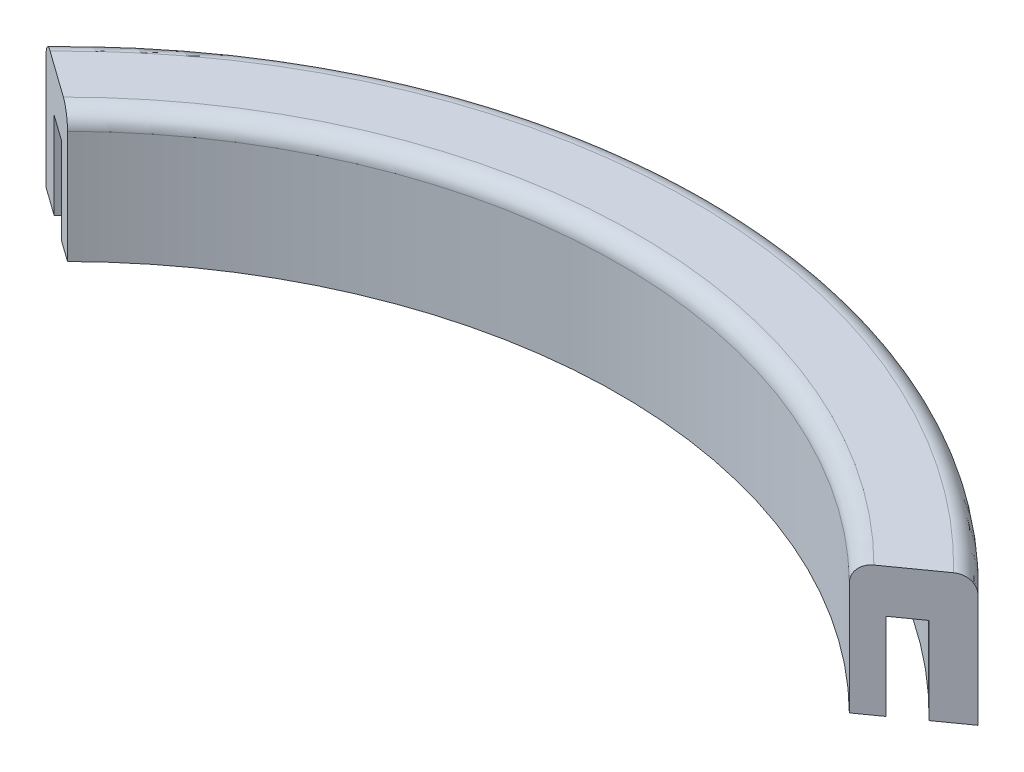
ISO-10303-21;
HEADER;
FILE_DESCRIPTION(('STEP AP214'),'2;1');
FILE_NAME('part.step','',(''),(''),'','','');
FILE_SCHEMA(('AUTOMOTIVE_DESIGN { 1 0 10303 214 1 1 1 1 }'));
ENDSEC;
DATA;
#1=APPLICATION_CONTEXT('core data for automotive mechanical design processes');
#2=APPLICATION_PROTOCOL_DEFINITION('international standard','automotive_design',2000,#1);
#3=PRODUCT_CONTEXT('',#1,'mechanical');
#4=PRODUCT('Part','Part','',(#3));
#5=PRODUCT_RELATED_PRODUCT_CATEGORY('part','',(#4));
#6=PRODUCT_DEFINITION_FORMATION('','',#4);
#7=PRODUCT_DEFINITION_CONTEXT('part definition',#1,'design');
#8=PRODUCT_DEFINITION('design','',#6,#7);
#9=PRODUCT_DEFINITION_SHAPE('','',#8);
#10=(LENGTH_UNIT() NAMED_UNIT(*) SI_UNIT(.MILLI.,.METRE.));
#11=(NAMED_UNIT(*) PLANE_ANGLE_UNIT() SI_UNIT($,.RADIAN.));
#12=(NAMED_UNIT(*) SI_UNIT($,.STERADIAN.) SOLID_ANGLE_UNIT());
#13=UNCERTAINTY_MEASURE_WITH_UNIT(LENGTH_MEASURE(1.E-05),#10,'distance_accuracy_value','');
#14=(GEOMETRIC_REPRESENTATION_CONTEXT(3) GLOBAL_UNCERTAINTY_ASSIGNED_CONTEXT((#13)) GLOBAL_UNIT_ASSIGNED_CONTEXT((#10,
#11,#12)) REPRESENTATION_CONTEXT('',''));
#15=CARTESIAN_POINT('',(0.,0.,0.));
#16=DIRECTION('',(0.,0.,1.));
#17=DIRECTION('',(1.,0.,0.));
#18=AXIS2_PLACEMENT_3D('',#15,#16,#17);
#19=CARTESIAN_POINT('',(0.,0.,0.));
#20=DIRECTION('',(0.,-1.,0.));
#21=DIRECTION('',(0.,0.,-1.));
#22=AXIS2_PLACEMENT_3D('',#19,#20,#21);
#23=PLANE('',#22);
#24=CARTESIAN_POINT('',(0.,0.,0.));
#25=DIRECTION('',(0.,-1.,0.));
#26=DIRECTION('',(0.,0.,-1.));
#27=AXIS2_PLACEMENT_3D('',#24,#25,#26);
#28=CIRCLE('',#27,89.535);
#29=CARTESIAN_POINT('',(-64.0434533645431,0.,-62.569579718451));
#30=VERTEX_POINT('',#29);
#31=CARTESIAN_POINT('',(64.0434533645431,0.,-62.569579718451));
#32=VERTEX_POINT('',#31);
#33=EDGE_CURVE('E122',#30,#32,#28,.T.);
#34=ORIENTED_EDGE('',*,*,#33,.F.);
#35=DIRECTION('',(0.814035572170162,0.,0.580815019814052));
#36=VECTOR('',#35,1.);
#37=CARTESIAN_POINT('',(-57.2347353310245,0.,-57.7115540562509));
#38=LINE('',#37,#36);
#39=CARTESIAN_POINT('',(-68.2255935502987,0.,-65.5535400242385));
#40=VERTEX_POINT('',#39);
#41=EDGE_CURVE('E181',#40,#30,#38,.T.);
#42=ORIENTED_EDGE('',*,*,#41,.F.);
#43=CARTESIAN_POINT('',(0.,0.,0.));
#44=DIRECTION('',(0.,1.,0.));
#45=DIRECTION('',(0.,0.,-1.));
#46=AXIS2_PLACEMENT_3D('',#43,#44,#45);
#47=CIRCLE('',#46,94.615);
#48=CARTESIAN_POINT('',(68.2255935502987,0.,-65.5535400242385));
#49=VERTEX_POINT('',#48);
#50=EDGE_CURVE('E160',#49,#40,#47,.T.);
#51=ORIENTED_EDGE('',*,*,#50,.F.);
#52=DIRECTION('',(0.814035572170162,0.,-0.580815019814052));
#53=VECTOR('',#52,1.);
#54=CARTESIAN_POINT('',(57.2347353310245,0.,-57.7115540562509));
#55=LINE('',#54,#53);
#56=EDGE_CURVE('E189',#32,#49,#55,.T.);
#57=ORIENTED_EDGE('',*,*,#56,.F.);
#58=EDGE_LOOP('',(#34,#42,#51,#57));
#59=FACE_BOUND('',#58,.T.);
#60=ADVANCED_FACE('F38',(#59),#23,.T.);
#61=CARTESIAN_POINT('',(0.,19.05,0.));
#62=DIRECTION('',(0.,-1.,0.));
#63=DIRECTION('',(0.,0.,-1.));
#64=AXIS2_PLACEMENT_3D('',#61,#62,#63);
#65=CYLINDRICAL_SURFACE('',#64,94.615);
#66=DIRECTION('',(0.,-1.,0.));
#67=VECTOR('',#66,1.);
#68=CARTESIAN_POINT('',(-68.2255935502987,19.05,-65.5535400242385));
#69=LINE('',#68,#67);
#70=CARTESIAN_POINT('',(-68.2255935502987,16.51,-65.5535400242385));
#71=VERTEX_POINT('',#70);
#72=EDGE_CURVE('E200',#71,#40,#69,.T.);
#73=ORIENTED_EDGE('',*,*,#72,.F.);
#74=CARTESIAN_POINT('',(0.,16.51,0.));
#75=DIRECTION('',(0.,-1.,0.));
#76=DIRECTION('',(0.,0.,-1.));
#77=AXIS2_PLACEMENT_3D('',#74,#75,#76);
#78=CIRCLE('',#77,94.615);
#79=CARTESIAN_POINT('',(68.2255935502987,16.51,-65.5535400242385));
#80=VERTEX_POINT('',#79);
#81=EDGE_CURVE('E11',#71,#80,#78,.T.);
#82=ORIENTED_EDGE('',*,*,#81,.T.);
#83=DIRECTION('',(0.,-1.,0.));
#84=VECTOR('',#83,1.);
#85=CARTESIAN_POINT('',(68.2255935502987,19.05,-65.5535400242385));
#86=LINE('',#85,#84);
#87=EDGE_CURVE('E176',#80,#49,#86,.T.);
#88=ORIENTED_EDGE('',*,*,#87,.T.);
#89=ORIENTED_EDGE('',*,*,#50,.T.);
#90=EDGE_LOOP('',(#73,#82,#88,#89));
#91=FACE_BOUND('',#90,.T.);
#92=ADVANCED_FACE('F240',(#91),#65,.T.);
#93=CARTESIAN_POINT('',(-57.2347353310245,19.05,-57.7115540562509));
#94=DIRECTION('',(0.580815019814052,0.,-0.814035572170162));
#95=DIRECTION('',(-0.814035572170162,0.,-0.580815019814052));
#96=AXIS2_PLACEMENT_3D('',#93,#94,#95);
#97=PLANE('',#96);
#98=DIRECTION('',(0.,-1.,0.));
#99=VECTOR('',#98,1.);
#100=CARTESIAN_POINT('',(-57.2347353310245,19.05,-57.7115540562509));
#101=LINE('',#100,#99);
#102=CARTESIAN_POINT('',(-57.2347353310245,16.51,-57.7115540562509));
#103=VERTEX_POINT('',#102);
#104=CARTESIAN_POINT('',(-57.2347353310245,0.,-57.7115540562509));
#105=VERTEX_POINT('',#104);
#106=EDGE_CURVE('E197',#103,#105,#101,.T.);
#107=ORIENTED_EDGE('',*,*,#106,.F.);
#108=CARTESIAN_POINT('',(-57.2347353310245,16.51,-57.7115540562509));
#109=CARTESIAN_POINT('',(-57.2347292125334,16.5807027289296,-57.7115496907027));
#110=CARTESIAN_POINT('',(-57.237173461785,16.6514018811038,-57.7132936644626));
#111=CARTESIAN_POINT('',(-57.2469154589435,16.7922884303876,-57.7202445870833));
#112=CARTESIAN_POINT('',(-57.2542128303198,16.8624758667718,-57.7254512672892));
#113=CARTESIAN_POINT('',(-57.2736025490014,17.0017643360062,-57.7392858467908));
#114=CARTESIAN_POINT('',(-57.2856893010382,17.0708665391062,-57.7479097538579));
#115=CARTESIAN_POINT('',(-57.3145521117735,17.2075564949376,-57.7685033919767));
#116=CARTESIAN_POINT('',(-57.331328139965,17.2751442575184,-57.7804731012616));
#117=CARTESIAN_POINT('',(-57.3885344369747,17.4749666658083,-57.8212898390886));
#118=CARTESIAN_POINT('',(-57.4358538106855,17.6043381113576,-57.8550522493801));
#119=CARTESIAN_POINT('',(-57.5473638490288,17.8514867100328,-57.9346147492806));
#120=CARTESIAN_POINT('',(-57.6115535330716,17.969264536493,-57.9804141392382));
#121=CARTESIAN_POINT('',(-57.7553907269823,18.1908514799067,-58.0830420900151));
#122=CARTESIAN_POINT('',(-57.8351345444467,18.2945663658334,-58.1399393663799));
#123=CARTESIAN_POINT('',(-58.0075094791364,18.4843585711963,-58.2629290176065));
#124=CARTESIAN_POINT('',(-58.1001434481603,18.5704319772076,-58.3290234272288));
#125=CARTESIAN_POINT('',(-58.297004126405,18.7237328887879,-58.4694836757047));
#126=CARTESIAN_POINT('',(-58.4013722475935,18.7906861021638,-58.5439504121084));
#127=CARTESIAN_POINT('',(-58.6176848437346,18.9023906695845,-58.6982896192745));
#128=CARTESIAN_POINT('',(-58.7296262860345,18.9471508514795,-58.7781599262368));
#129=CARTESIAN_POINT('',(-58.9236696217515,19.0034225981474,-58.9166099986074));
#130=CARTESIAN_POINT('',(-59.0046645237337,19.0208776014887,-58.974399924758));
#131=CARTESIAN_POINT('',(-59.1676387969249,19.0441658601325,-59.0906821966253));
#132=CARTESIAN_POINT('',(-59.2496166306025,19.0500153566809,-59.1491734453122));
#133=CARTESIAN_POINT('',(-59.33162764036,19.05,-59.2076883651581));
#134=B_SPLINE_CURVE_WITH_KNOTS('',3,(#108,#109,#110,#111,#112,#113,#114,#115,#116,#117,#118,
#119,#120,#121,#122,#123,#124,#125,#126,#127,#128,#129,#130,#131,#132,#133),.UNSPECIFIED.,.F.,
.F.,(4,2,2,2,2,2,2,2,2,2,2,2,4),(0.,0.212038091459266,0.424059733814965,0.635834405439172,
0.84760769935326,1.27092079623805,1.69420929341764,2.12020703134357,2.54629916668803,
2.97822772417059,3.40998433282428,3.71239781108664,4.01438777954809),.UNSPECIFIED.);
#135=CARTESIAN_POINT('',(-59.33162764036,19.05,-59.2076883651581));
#136=VERTEX_POINT('',#135);
#137=EDGE_CURVE('E48',#103,#136,#134,.T.);
#138=ORIENTED_EDGE('',*,*,#137,.T.);
#139=DIRECTION('',(0.814035572170162,0.,0.580815019814052));
#140=VECTOR('',#139,1.);
#141=CARTESIAN_POINT('',(-57.2347353310245,19.05,-57.7115540562509));
#142=LINE('',#141,#140);
#143=CARTESIAN_POINT('',(-66.135180534394,19.05,-64.0620286962809));
#144=VERTEX_POINT('',#143);
#145=EDGE_CURVE('E167',#144,#136,#142,.T.);
#146=ORIENTED_EDGE('',*,*,#145,.F.);
#147=CARTESIAN_POINT('',(-66.135180534394,19.05,-64.0620286962809));
#148=CARTESIAN_POINT('',(-66.1944766345441,19.0499990825189,-64.1043365102894));
#149=CARTESIAN_POINT('',(-66.2537445496103,19.0469343988423,-64.1466242142182));
#150=CARTESIAN_POINT('',(-66.3718602879345,19.0347041977518,-64.230899886241));
#151=CARTESIAN_POINT('',(-66.4307081207936,19.0255388202253,-64.2728878611854));
#152=CARTESIAN_POINT('',(-66.60592574606,18.9889636862598,-64.3979057743701));
#153=CARTESIAN_POINT('',(-66.7211280670028,18.9524747643107,-64.4801027208041));
#154=CARTESIAN_POINT('',(-66.944916393503,18.8562241883581,-64.6397758674503));
#155=CARTESIAN_POINT('',(-67.0534983635128,18.796448500339,-64.7172491882962));
#156=CARTESIAN_POINT('',(-67.2608804153753,18.6552441228344,-64.8652164451084));
#157=CARTESIAN_POINT('',(-67.3596831639858,18.5738213588759,-64.9357122838086));
#158=CARTESIAN_POINT('',(-67.5441121893266,18.3920493313781,-65.0673025381779));
#159=CARTESIAN_POINT('',(-67.6298062095813,18.2918037815529,-65.128445288905));
#160=CARTESIAN_POINT('',(-67.7861215462134,18.074869035856,-65.2399764043097));
#161=CARTESIAN_POINT('',(-67.8567402340852,17.9581769782823,-65.2903628935465));
#162=CARTESIAN_POINT('',(-67.9800986166503,17.712978258467,-65.378379196351));
#163=CARTESIAN_POINT('',(-68.0330138578835,17.5846047019455,-65.4161342625127));
#164=CARTESIAN_POINT('',(-68.1203252283969,17.3187268271553,-65.4784309939192));
#165=CARTESIAN_POINT('',(-68.1547350577661,17.1812293485447,-65.502982434188));
#166=CARTESIAN_POINT('',(-68.1947373250157,16.9539576725633,-65.531524083275));
#167=CARTESIAN_POINT('',(-68.2063016752937,16.8657030757747,-65.5397752562771));
#168=CARTESIAN_POINT('',(-68.2217280877653,16.6883122843,-65.5507820136863));
#169=CARTESIAN_POINT('',(-68.2256011816788,16.59917753685,-65.5535454692343));
#170=CARTESIAN_POINT('',(-68.2255935502987,16.51,-65.5535400242385));
#171=B_SPLINE_CURVE_WITH_KNOTS('',3,(#147,#148,#149,#150,#151,#152,#153,#154,#155,#156,#157,
#158,#159,#160,#161,#162,#163,#164,#165,#166,#167,#168,#169,#170),.UNSPECIFIED.,.F.,.F.,(4,2,2,
2,2,2,2,2,2,2,2,4),(0.,0.218393054742541,0.436781101963117,0.872980821932522,1.3094438299623,
1.74578748629325,2.17979391786544,2.61387596025898,3.04351642178407,3.47283836871294,
3.74054492114632,4.00786721867657),.UNSPECIFIED.);
#172=EDGE_CURVE('E55',#144,#71,#171,.T.);
#173=ORIENTED_EDGE('',*,*,#172,.T.);
#174=ORIENTED_EDGE('',*,*,#72,.T.);
#175=ORIENTED_EDGE('',*,*,#41,.T.);
#176=DIRECTION('',(0.,-1.,0.));
#177=VECTOR('',#176,1.);
#178=CARTESIAN_POINT('',(-64.0434533645431,12.7,-62.569579718451));
#179=LINE('',#178,#177);
#180=CARTESIAN_POINT('',(-64.0434533645431,12.7,-62.569579718451));
#181=VERTEX_POINT('',#180);
#182=EDGE_CURVE('E157',#181,#30,#179,.T.);
#183=ORIENTED_EDGE('',*,*,#182,.F.);
#184=DIRECTION('',(-0.814035572170162,0.,-0.580815019814051));
#185=VECTOR('',#184,1.);
#186=CARTESIAN_POINT('',(-60.3794057355663,12.7,-59.9552788586615));
#187=LINE('',#186,#185);
#188=CARTESIAN_POINT('',(-60.3794057355663,12.7,-59.9552788586615));
#189=VERTEX_POINT('',#188);
#190=EDGE_CURVE('E129',#189,#181,#187,.T.);
#191=ORIENTED_EDGE('',*,*,#190,.F.);
#192=DIRECTION('',(0.,-1.,0.));
#193=VECTOR('',#192,1.);
#194=CARTESIAN_POINT('',(-60.3794057355663,12.7,-59.9552788586615));
#195=LINE('',#194,#193);
#196=CARTESIAN_POINT('',(-60.3794057355663,0.,-59.9552788586615));
#197=VERTEX_POINT('',#196);
#198=EDGE_CURVE('E161',#189,#197,#195,.T.);
#199=ORIENTED_EDGE('',*,*,#198,.T.);
#200=EDGE_CURVE('E180',#197,#105,#38,.T.);
#201=ORIENTED_EDGE('',*,*,#200,.T.);
#202=EDGE_LOOP('',(#107,#138,#146,#173,#174,#175,#183,#191,#199,#201));
#203=FACE_BOUND('',#202,.T.);
#204=ADVANCED_FACE('F236',(#203),#97,.F.);
#205=CARTESIAN_POINT('',(0.,19.05,0.));
#206=DIRECTION('',(0.,-1.,0.));
#207=DIRECTION('',(0.,0.,-1.));
#208=AXIS2_PLACEMENT_3D('',#205,#206,#207);
#209=CYLINDRICAL_SURFACE('',#208,81.28);
#210=DIRECTION('',(0.,-1.,0.));
#211=VECTOR('',#210,1.);
#212=CARTESIAN_POINT('',(57.2347353310245,19.05,-57.711554056251));
#213=LINE('',#212,#211);
#214=CARTESIAN_POINT('',(57.2347353310245,16.51,-57.711554056251));
#215=VERTEX_POINT('',#214);
#216=CARTESIAN_POINT('',(57.2347353310245,0.,-57.711554056251));
#217=VERTEX_POINT('',#216);
#218=EDGE_CURVE('E194',#215,#217,#213,.T.);
#219=ORIENTED_EDGE('',*,*,#218,.F.);
#220=CARTESIAN_POINT('',(0.,16.51,0.));
#221=DIRECTION('',(0.,-1.,0.));
#222=DIRECTION('',(0.,0.,-1.));
#223=AXIS2_PLACEMENT_3D('',#220,#221,#222);
#224=CIRCLE('',#223,81.28);
#225=EDGE_CURVE('E63',#215,#103,#224,.F.);
#226=ORIENTED_EDGE('',*,*,#225,.T.);
#227=ORIENTED_EDGE('',*,*,#106,.T.);
#228=CARTESIAN_POINT('',(0.,0.,0.));
#229=DIRECTION('',(0.,-1.,0.));
#230=DIRECTION('',(0.,0.,-1.));
#231=AXIS2_PLACEMENT_3D('',#228,#229,#230);
#232=CIRCLE('',#231,81.28);
#233=EDGE_CURVE('E185',#105,#217,#232,.T.);
#234=ORIENTED_EDGE('',*,*,#233,.T.);
#235=EDGE_LOOP('',(#219,#226,#227,#234));
#236=FACE_BOUND('',#235,.T.);
#237=ADVANCED_FACE('F230',(#236),#209,.F.);
#238=CARTESIAN_POINT('',(57.2347353310245,19.05,-57.7115540562509));
#239=DIRECTION('',(-0.580815019814052,0.,-0.814035572170162));
#240=DIRECTION('',(-0.814035572170162,0.,0.580815019814052));
#241=AXIS2_PLACEMENT_3D('',#238,#239,#240);
#242=PLANE('',#241);
#243=DIRECTION('',(0.814035572170162,0.,-0.580815019814052));
#244=VECTOR('',#243,1.);
#245=CARTESIAN_POINT('',(57.2347353310245,19.05,-57.7115540562509));
#246=LINE('',#245,#244);
#247=CARTESIAN_POINT('',(59.33162764036,19.05,-59.2076883651581));
#248=VERTEX_POINT('',#247);
#249=CARTESIAN_POINT('',(66.135180534394,19.05,-64.0620286962809));
#250=VERTEX_POINT('',#249);
#251=EDGE_CURVE('E171',#248,#250,#246,.T.);
#252=ORIENTED_EDGE('',*,*,#251,.F.);
#253=CARTESIAN_POINT('',(59.33162764036,19.05,-59.207688365158));
#254=CARTESIAN_POINT('',(59.2720307100916,19.0499989865762,-59.1651659086241));
#255=CARTESIAN_POINT('',(59.2124622206863,19.0469178037369,-59.1226637446683));
#256=CARTESIAN_POINT('',(59.0937476134898,19.0346234586212,-59.0379607792349));
#257=CARTESIAN_POINT('',(59.0346014854869,19.025410445108,-58.9957599704713));
#258=CARTESIAN_POINT('',(58.8584898007428,18.9886471361571,-58.8701041451474));
#259=CARTESIAN_POINT('',(58.7426976591911,18.9519724062892,-58.7874863612459));
#260=CARTESIAN_POINT('',(58.5177626514951,18.8552341443721,-58.6269950566663));
#261=CARTESIAN_POINT('',(58.4086238022919,18.795156641457,-58.5491244020787));
#262=CARTESIAN_POINT('',(58.2001833849622,18.6532254801437,-58.4004020006748));
#263=CARTESIAN_POINT('',(58.1008790762764,18.5713779119044,-58.3295482984671));
#264=CARTESIAN_POINT('',(57.9155953314868,18.3886800555013,-58.1973482011));
#265=CARTESIAN_POINT('',(57.8295401492133,18.287945696252,-58.135947760989));
#266=CARTESIAN_POINT('',(57.6726233060894,18.0699187749397,-58.0239874702301));
#267=CARTESIAN_POINT('',(57.6017641295827,17.9526235105804,-57.9734293921636));
#268=CARTESIAN_POINT('',(57.4782780315429,17.7064784967689,-57.8853219642676));
#269=CARTESIAN_POINT('',(57.4254250990078,17.5777996406921,-57.8476113554108));
#270=CARTESIAN_POINT('',(57.3383527924462,17.311304206886,-57.7854851963218));
#271=CARTESIAN_POINT('',(57.3041186439895,17.1734949720303,-57.7610591045219));
#272=CARTESIAN_POINT('',(57.2647700616797,16.9472164663215,-57.7329838601526));
#273=CARTESIAN_POINT('',(57.2535136785064,16.8602885545611,-57.7249524219215));
#274=CARTESIAN_POINT('',(57.2384981000984,16.6855871758799,-57.7142387949392));
#275=CARTESIAN_POINT('',(57.2347281972873,16.5978150972714,-57.7115489663238));
#276=CARTESIAN_POINT('',(57.2347353310245,16.51,-57.7115540562509));
#277=B_SPLINE_CURVE_WITH_KNOTS('',3,(#253,#254,#255,#256,#257,#258,#259,#260,#261,#262,#263,
#264,#265,#266,#267,#268,#269,#270,#271,#272,#273,#274,#275,#276),.UNSPECIFIED.,.F.,.F.,(4,2,2,
2,2,2,2,2,2,2,2,4),(0.,0.219500808583012,0.43899629209008,0.877429504633983,1.31612485286171,
1.75469760524803,2.19066161547289,2.62669684574215,3.05703788848829,3.48703694569282,
3.75065357208347,4.01389288712502),.UNSPECIFIED.);
#278=EDGE_CURVE('E219',#248,#215,#277,.T.);
#279=ORIENTED_EDGE('',*,*,#278,.T.);
#280=ORIENTED_EDGE('',*,*,#218,.T.);
#281=CARTESIAN_POINT('',(60.3794057355664,0.,-59.9552788586615));
#282=VERTEX_POINT('',#281);
#283=EDGE_CURVE('E172',#217,#282,#55,.T.);
#284=ORIENTED_EDGE('',*,*,#283,.T.);
#285=DIRECTION('',(0.,-1.,0.));
#286=VECTOR('',#285,1.);
#287=CARTESIAN_POINT('',(60.3794057355663,12.7,-59.9552788586615));
#288=LINE('',#287,#286);
#289=CARTESIAN_POINT('',(60.3794057355663,12.7,-59.9552788586615));
#290=VERTEX_POINT('',#289);
#291=EDGE_CURVE('E128',#290,#282,#288,.T.);
#292=ORIENTED_EDGE('',*,*,#291,.F.);
#293=DIRECTION('',(-0.814035572170164,0.,0.580815019814049));
#294=VECTOR('',#293,1.);
#295=CARTESIAN_POINT('',(64.0434533645431,12.7,-62.569579718451));
#296=LINE('',#295,#294);
#297=CARTESIAN_POINT('',(64.0434533645431,12.7,-62.569579718451));
#298=VERTEX_POINT('',#297);
#299=EDGE_CURVE('E135',#298,#290,#296,.T.);
#300=ORIENTED_EDGE('',*,*,#299,.F.);
#301=DIRECTION('',(0.,-1.,0.));
#302=VECTOR('',#301,1.);
#303=CARTESIAN_POINT('',(64.0434533645431,12.7,-62.569579718451));
#304=LINE('',#303,#302);
#305=EDGE_CURVE('E116',#298,#32,#304,.T.);
#306=ORIENTED_EDGE('',*,*,#305,.T.);
#307=ORIENTED_EDGE('',*,*,#56,.T.);
#308=ORIENTED_EDGE('',*,*,#87,.F.);
#309=CARTESIAN_POINT('',(68.2255935502987,16.51,-65.5535400242385));
#310=CARTESIAN_POINT('',(68.2255995007909,16.580887602523,-65.5535442699194));
#311=CARTESIAN_POINT('',(68.2231520299304,16.6517717319816,-65.551797997539));
#312=CARTESIAN_POINT('',(68.2133962144063,16.793028678911,-65.5448372155036));
#313=CARTESIAN_POINT('',(68.2060882034256,16.8634015311466,-65.5396229439316));
#314=CARTESIAN_POINT('',(68.1866674448129,17.0030682164127,-65.5257662174149));
#315=CARTESIAN_POINT('',(68.174559739665,17.0723631027894,-65.5171273602866));
#316=CARTESIAN_POINT('',(68.1456431584469,17.2094358711854,-65.496495356886));
#317=CARTESIAN_POINT('',(68.1288343212423,17.277213765741,-65.4845022383445));
#318=CARTESIAN_POINT('',(68.0715060803796,17.4776060035202,-65.4435984934826));
#319=CARTESIAN_POINT('',(68.0240749294032,17.6073504658334,-65.4097563300245));
#320=CARTESIAN_POINT('',(67.9122617261247,17.8551887018224,-65.3299775217046));
#321=CARTESIAN_POINT('',(67.8478812557475,17.9732835613731,-65.2840420055476));
#322=CARTESIAN_POINT('',(67.703700136525,18.1952004091384,-65.1811686637909));
#323=CARTESIAN_POINT('',(67.6238304365488,18.2989547810467,-65.124181570155));
#324=CARTESIAN_POINT('',(67.4511565751371,18.4887314470089,-65.0009786344776));
#325=CARTESIAN_POINT('',(67.3583496790741,18.5747499825575,-64.9347608412772));
#326=CARTESIAN_POINT('',(67.1614456136045,18.7275363459483,-64.7942696359822));
#327=CARTESIAN_POINT('',(67.0572426329645,18.7940981827114,-64.7199207274895));
#328=CARTESIAN_POINT('',(66.8412966894481,18.9050007897097,-64.5658431272589));
#329=CARTESIAN_POINT('',(66.7295569668992,18.9493510413056,-64.4861167474974));
#330=CARTESIAN_POINT('',(66.5369209599593,19.0046164717056,-64.3486708053141));
#331=CARTESIAN_POINT('',(66.4571460328771,19.0216257816651,-64.2917513322124));
#332=CARTESIAN_POINT('',(66.2966508857626,19.0443168056145,-64.1772379187472));
#333=CARTESIAN_POINT('',(66.2159321722055,19.0500146022591,-64.1196450532547));
#334=CARTESIAN_POINT('',(66.135180534394,19.05,-64.0620286962809));
#335=B_SPLINE_CURVE_WITH_KNOTS('',3,(#309,#310,#311,#312,#313,#314,#315,#316,#317,#318,#319,
#320,#321,#322,#323,#324,#325,#326,#327,#328,#329,#330,#331,#332,#333,#334),.UNSPECIFIED.,.F.,
.F.,(4,2,2,2,2,2,2,2,2,2,2,2,4),(0.,0.212592870191641,0.425171147091959,0.637526681931899,
0.849880461216148,1.27437291793105,1.6988257696759,2.12521623882518,2.55169697422522,
2.98254170872155,3.41320237335247,3.71098119951669,4.00833634110515),.UNSPECIFIED.);
#336=EDGE_CURVE('E211',#80,#250,#335,.T.);
#337=ORIENTED_EDGE('',*,*,#336,.T.);
#338=EDGE_LOOP('',(#252,#279,#280,#284,#292,#300,#306,#307,#308,#337));
#339=FACE_BOUND('',#338,.T.);
#340=ADVANCED_FACE('F143',(#339),#242,.F.);
#341=CARTESIAN_POINT('',(0.,19.05,0.));
#342=DIRECTION('',(0.,-1.,0.));
#343=DIRECTION('',(0.,0.,-1.));
#344=AXIS2_PLACEMENT_3D('',#341,#342,#343);
#345=PLANE('',#344);
#346=ORIENTED_EDGE('',*,*,#145,.T.);
#347=CARTESIAN_POINT('',(0.,19.05,0.));
#348=DIRECTION('',(0.,-1.,0.));
#349=DIRECTION('',(0.,0.,-1.));
#350=AXIS2_PLACEMENT_3D('',#347,#348,#349);
#351=CIRCLE('',#350,83.82);
#352=EDGE_CURVE('E207',#136,#248,#351,.T.);
#353=ORIENTED_EDGE('',*,*,#352,.T.);
#354=ORIENTED_EDGE('',*,*,#251,.T.);
#355=CARTESIAN_POINT('',(0.,19.05,0.));
#356=DIRECTION('',(0.,-1.,0.));
#357=DIRECTION('',(0.,0.,-1.));
#358=AXIS2_PLACEMENT_3D('',#355,#356,#357);
#359=CIRCLE('',#358,92.075);
#360=EDGE_CURVE('E203',#250,#144,#359,.F.);
#361=ORIENTED_EDGE('',*,*,#360,.T.);
#362=EDGE_LOOP('',(#346,#353,#354,#361));
#363=FACE_BOUND('',#362,.T.);
#364=ADVANCED_FACE('F229',(#363),#345,.F.);
#365=CARTESIAN_POINT('',(0.,0.,0.));
#366=DIRECTION('',(0.,1.,0.));
#367=DIRECTION('',(0.,0.,-1.));
#368=AXIS2_PLACEMENT_3D('',#365,#366,#367);
#369=CIRCLE('',#368,85.09);
#370=EDGE_CURVE('E140',#282,#197,#369,.T.);
#371=ORIENTED_EDGE('',*,*,#370,.F.);
#372=ORIENTED_EDGE('',*,*,#283,.F.);
#373=ORIENTED_EDGE('',*,*,#233,.F.);
#374=ORIENTED_EDGE('',*,*,#200,.F.);
#375=EDGE_LOOP('',(#371,#372,#373,#374));
#376=FACE_BOUND('',#375,.T.);
#377=ADVANCED_FACE('F231',(#376),#23,.T.);
#378=CARTESIAN_POINT('',(0.,12.7,0.));
#379=DIRECTION('',(0.,-1.,0.));
#380=DIRECTION('',(0.,0.,-1.));
#381=AXIS2_PLACEMENT_3D('',#378,#379,#380);
#382=CYLINDRICAL_SURFACE('',#381,89.535);
#383=ORIENTED_EDGE('',*,*,#33,.T.);
#384=ORIENTED_EDGE('',*,*,#305,.F.);
#385=CARTESIAN_POINT('',(0.,12.7,0.));
#386=DIRECTION('',(0.,-1.,0.));
#387=DIRECTION('',(0.,0.,-1.));
#388=AXIS2_PLACEMENT_3D('',#385,#386,#387);
#389=CIRCLE('',#388,89.535);
#390=EDGE_CURVE('E119',#181,#298,#389,.T.);
#391=ORIENTED_EDGE('',*,*,#390,.F.);
#392=ORIENTED_EDGE('',*,*,#182,.T.);
#393=EDGE_LOOP('',(#383,#384,#391,#392));
#394=FACE_BOUND('',#393,.T.);
#395=ADVANCED_FACE('F118',(#394),#382,.F.);
#396=CARTESIAN_POINT('',(0.,12.7,0.));
#397=DIRECTION('',(0.,-1.,0.));
#398=DIRECTION('',(0.,0.,-1.));
#399=AXIS2_PLACEMENT_3D('',#396,#397,#398);
#400=CYLINDRICAL_SURFACE('',#399,85.09);
#401=ORIENTED_EDGE('',*,*,#370,.T.);
#402=ORIENTED_EDGE('',*,*,#198,.F.);
#403=CARTESIAN_POINT('',(0.,12.7,0.));
#404=DIRECTION('',(0.,1.,0.));
#405=DIRECTION('',(0.,0.,-1.));
#406=AXIS2_PLACEMENT_3D('',#403,#404,#405);
#407=CIRCLE('',#406,85.09);
#408=EDGE_CURVE('E146',#290,#189,#407,.T.);
#409=ORIENTED_EDGE('',*,*,#408,.F.);
#410=ORIENTED_EDGE('',*,*,#291,.T.);
#411=EDGE_LOOP('',(#401,#402,#409,#410));
#412=FACE_BOUND('',#411,.T.);
#413=ADVANCED_FACE('F262',(#412),#400,.T.);
#414=CARTESIAN_POINT('',(0.,12.7,0.));
#415=DIRECTION('',(0.,-1.,0.));
#416=DIRECTION('',(0.,0.,-1.));
#417=AXIS2_PLACEMENT_3D('',#414,#415,#416);
#418=PLANE('',#417);
#419=ORIENTED_EDGE('',*,*,#390,.T.);
#420=ORIENTED_EDGE('',*,*,#299,.T.);
#421=ORIENTED_EDGE('',*,*,#408,.T.);
#422=ORIENTED_EDGE('',*,*,#190,.T.);
#423=EDGE_LOOP('',(#419,#420,#421,#422));
#424=FACE_BOUND('',#423,.T.);
#425=ADVANCED_FACE('F133',(#424),#418,.T.);
#426=CARTESIAN_POINT('',(0.,16.51,0.));
#427=DIRECTION('',(0.,-1.,0.));
#428=DIRECTION('',(0.,0.,-1.));
#429=AXIS2_PLACEMENT_3D('',#426,#427,#428);
#430=TOROIDAL_SURFACE('',#429,83.82,2.54);
#431=ORIENTED_EDGE('',*,*,#137,.F.);
#432=ORIENTED_EDGE('',*,*,#225,.F.);
#433=ORIENTED_EDGE('',*,*,#278,.F.);
#434=ORIENTED_EDGE('',*,*,#352,.F.);
#435=EDGE_LOOP('',(#431,#432,#433,#434));
#436=FACE_BOUND('',#435,.T.);
#437=ADVANCED_FACE('F252',(#436),#430,.T.);
#438=CARTESIAN_POINT('',(0.,16.51,0.));
#439=DIRECTION('',(0.,-1.,0.));
#440=DIRECTION('',(0.,0.,-1.));
#441=AXIS2_PLACEMENT_3D('',#438,#439,#440);
#442=TOROIDAL_SURFACE('',#441,92.075,2.54);
#443=ORIENTED_EDGE('',*,*,#336,.F.);
#444=ORIENTED_EDGE('',*,*,#81,.F.);
#445=ORIENTED_EDGE('',*,*,#172,.F.);
#446=ORIENTED_EDGE('',*,*,#360,.F.);
#447=EDGE_LOOP('',(#443,#444,#445,#446));
#448=FACE_BOUND('',#447,.T.);
#449=ADVANCED_FACE('F40',(#448),#442,.T.);
#450=CLOSED_SHELL('',(#60,#92,#204,#237,#340,#364,#377,#395,#413,#425,#437,#449));
#451=MANIFOLD_SOLID_BREP('B2',#450);
#452=ADVANCED_BREP_SHAPE_REPRESENTATION('',(#18,#451),#14);
#453=SHAPE_DEFINITION_REPRESENTATION(#9,#452);
ENDSEC;
END-ISO-10303-21;
